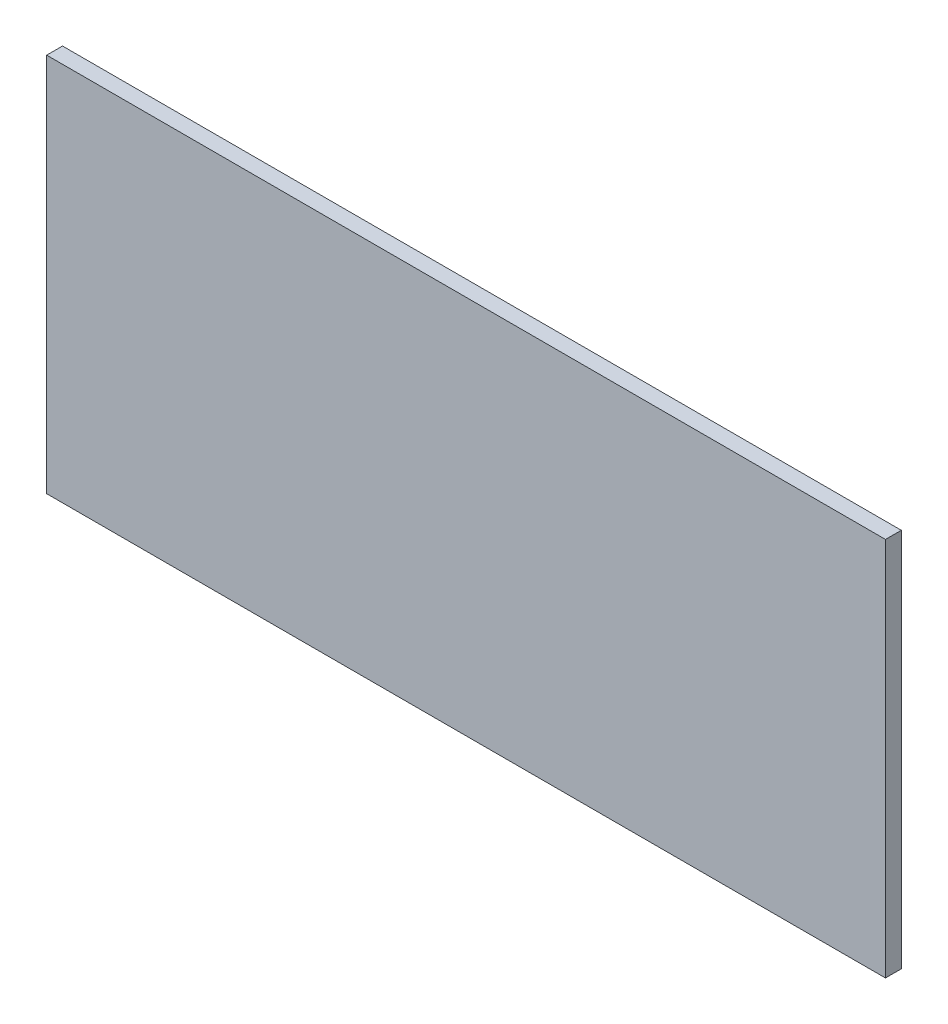
ISO-10303-21;
HEADER;
FILE_DESCRIPTION(('STEP AP214'),'2;1');
FILE_NAME('part.step','',(''),(''),'','','');
FILE_SCHEMA(('AUTOMOTIVE_DESIGN { 1 0 10303 214 1 1 1 1 }'));
ENDSEC;
DATA;
#1=APPLICATION_CONTEXT('core data for automotive mechanical design processes');
#2=APPLICATION_PROTOCOL_DEFINITION('international standard','automotive_design',2000,#1);
#3=PRODUCT_CONTEXT('',#1,'mechanical');
#4=PRODUCT('Part','Part','',(#3));
#5=PRODUCT_RELATED_PRODUCT_CATEGORY('part','',(#4));
#6=PRODUCT_DEFINITION_FORMATION('','',#4);
#7=PRODUCT_DEFINITION_CONTEXT('part definition',#1,'design');
#8=PRODUCT_DEFINITION('design','',#6,#7);
#9=PRODUCT_DEFINITION_SHAPE('','',#8);
#10=(LENGTH_UNIT() NAMED_UNIT(*) SI_UNIT(.MILLI.,.METRE.));
#11=(NAMED_UNIT(*) PLANE_ANGLE_UNIT() SI_UNIT($,.RADIAN.));
#12=(NAMED_UNIT(*) SI_UNIT($,.STERADIAN.) SOLID_ANGLE_UNIT());
#13=UNCERTAINTY_MEASURE_WITH_UNIT(LENGTH_MEASURE(1.E-05),#10,'distance_accuracy_value','');
#14=(GEOMETRIC_REPRESENTATION_CONTEXT(3) GLOBAL_UNCERTAINTY_ASSIGNED_CONTEXT((#13)) GLOBAL_UNIT_ASSIGNED_CONTEXT((#10,
#11,#12)) REPRESENTATION_CONTEXT('',''));
#15=CARTESIAN_POINT('',(0.,0.,0.));
#16=DIRECTION('',(0.,0.,1.));
#17=DIRECTION('',(1.,0.,0.));
#18=AXIS2_PLACEMENT_3D('',#15,#16,#17);
#19=CARTESIAN_POINT('',(-265.,-120.,10.));
#20=DIRECTION('',(0.,1.,0.));
#21=DIRECTION('',(0.,0.,1.));
#22=AXIS2_PLACEMENT_3D('',#19,#20,#21);
#23=PLANE('',#22);
#24=DIRECTION('',(1.,0.,0.));
#25=VECTOR('',#24,1.);
#26=CARTESIAN_POINT('',(-265.,-120.,0.));
#27=LINE('',#26,#25);
#28=CARTESIAN_POINT('',(-265.,-120.,0.));
#29=VERTEX_POINT('',#28);
#30=CARTESIAN_POINT('',(265.,-120.,0.));
#31=VERTEX_POINT('',#30);
#32=EDGE_CURVE('E96',#29,#31,#27,.T.);
#33=ORIENTED_EDGE('',*,*,#32,.T.);
#34=DIRECTION('',(0.,0.,-1.));
#35=VECTOR('',#34,1.);
#36=CARTESIAN_POINT('',(265.,-120.,10.));
#37=LINE('',#36,#35);
#38=CARTESIAN_POINT('',(265.,-120.,10.));
#39=VERTEX_POINT('',#38);
#40=EDGE_CURVE('E11',#39,#31,#37,.T.);
#41=ORIENTED_EDGE('',*,*,#40,.F.);
#42=DIRECTION('',(1.,0.,0.));
#43=VECTOR('',#42,1.);
#44=CARTESIAN_POINT('',(-265.,-120.,10.));
#45=LINE('',#44,#43);
#46=CARTESIAN_POINT('',(-265.,-120.,10.));
#47=VERTEX_POINT('',#46);
#48=EDGE_CURVE('E82',#47,#39,#45,.T.);
#49=ORIENTED_EDGE('',*,*,#48,.F.);
#50=DIRECTION('',(0.,0.,-1.));
#51=VECTOR('',#50,1.);
#52=CARTESIAN_POINT('',(-265.,-120.,10.));
#53=LINE('',#52,#51);
#54=EDGE_CURVE('E49',#47,#29,#53,.T.);
#55=ORIENTED_EDGE('',*,*,#54,.T.);
#56=EDGE_LOOP('',(#33,#41,#49,#55));
#57=FACE_BOUND('',#56,.T.);
#58=ADVANCED_FACE('F33',(#57),#23,.F.);
#59=CARTESIAN_POINT('',(265.,-120.,10.));
#60=DIRECTION('',(-1.,0.,0.));
#61=DIRECTION('',(0.,0.,1.));
#62=AXIS2_PLACEMENT_3D('',#59,#60,#61);
#63=PLANE('',#62);
#64=DIRECTION('',(0.,1.,0.));
#65=VECTOR('',#64,1.);
#66=CARTESIAN_POINT('',(265.,-120.,0.));
#67=LINE('',#66,#65);
#68=CARTESIAN_POINT('',(265.,120.,0.));
#69=VERTEX_POINT('',#68);
#70=EDGE_CURVE('E87',#31,#69,#67,.T.);
#71=ORIENTED_EDGE('',*,*,#70,.T.);
#72=DIRECTION('',(0.,0.,-1.));
#73=VECTOR('',#72,1.);
#74=CARTESIAN_POINT('',(265.,120.,10.));
#75=LINE('',#74,#73);
#76=CARTESIAN_POINT('',(265.,120.,10.));
#77=VERTEX_POINT('',#76);
#78=EDGE_CURVE('E41',#77,#69,#75,.T.);
#79=ORIENTED_EDGE('',*,*,#78,.F.);
#80=DIRECTION('',(0.,1.,0.));
#81=VECTOR('',#80,1.);
#82=CARTESIAN_POINT('',(265.,-120.,10.));
#83=LINE('',#82,#81);
#84=EDGE_CURVE('E74',#39,#77,#83,.T.);
#85=ORIENTED_EDGE('',*,*,#84,.F.);
#86=ORIENTED_EDGE('',*,*,#40,.T.);
#87=EDGE_LOOP('',(#71,#79,#85,#86));
#88=FACE_BOUND('',#87,.T.);
#89=ADVANCED_FACE('F86',(#88),#63,.F.);
#90=CARTESIAN_POINT('',(-265.,120.,10.));
#91=DIRECTION('',(0.,1.,0.));
#92=DIRECTION('',(0.,0.,1.));
#93=AXIS2_PLACEMENT_3D('',#90,#91,#92);
#94=PLANE('',#93);
#95=DIRECTION('',(1.,0.,0.));
#96=VECTOR('',#95,1.);
#97=CARTESIAN_POINT('',(-265.,120.,0.));
#98=LINE('',#97,#96);
#99=CARTESIAN_POINT('',(-265.,120.,0.));
#100=VERTEX_POINT('',#99);
#101=EDGE_CURVE('E99',#100,#69,#98,.T.);
#102=ORIENTED_EDGE('',*,*,#101,.F.);
#103=DIRECTION('',(0.,0.,-1.));
#104=VECTOR('',#103,1.);
#105=CARTESIAN_POINT('',(-265.,120.,10.));
#106=LINE('',#105,#104);
#107=CARTESIAN_POINT('',(-265.,120.,10.));
#108=VERTEX_POINT('',#107);
#109=EDGE_CURVE('E63',#108,#100,#106,.T.);
#110=ORIENTED_EDGE('',*,*,#109,.F.);
#111=DIRECTION('',(1.,0.,0.));
#112=VECTOR('',#111,1.);
#113=CARTESIAN_POINT('',(-265.,120.,10.));
#114=LINE('',#113,#112);
#115=EDGE_CURVE('E81',#108,#77,#114,.T.);
#116=ORIENTED_EDGE('',*,*,#115,.T.);
#117=ORIENTED_EDGE('',*,*,#78,.T.);
#118=EDGE_LOOP('',(#102,#110,#116,#117));
#119=FACE_BOUND('',#118,.T.);
#120=ADVANCED_FACE('F90',(#119),#94,.T.);
#121=CARTESIAN_POINT('',(-265.,-120.,10.));
#122=DIRECTION('',(-1.,0.,0.));
#123=DIRECTION('',(0.,0.,1.));
#124=AXIS2_PLACEMENT_3D('',#121,#122,#123);
#125=PLANE('',#124);
#126=DIRECTION('',(0.,1.,0.));
#127=VECTOR('',#126,1.);
#128=CARTESIAN_POINT('',(-265.,-120.,0.));
#129=LINE('',#128,#127);
#130=EDGE_CURVE('E101',#29,#100,#129,.T.);
#131=ORIENTED_EDGE('',*,*,#130,.F.);
#132=ORIENTED_EDGE('',*,*,#54,.F.);
#133=DIRECTION('',(0.,1.,0.));
#134=VECTOR('',#133,1.);
#135=CARTESIAN_POINT('',(-265.,-120.,10.));
#136=LINE('',#135,#134);
#137=EDGE_CURVE('E91',#47,#108,#136,.T.);
#138=ORIENTED_EDGE('',*,*,#137,.T.);
#139=ORIENTED_EDGE('',*,*,#109,.T.);
#140=EDGE_LOOP('',(#131,#132,#138,#139));
#141=FACE_BOUND('',#140,.T.);
#142=ADVANCED_FACE('F107',(#141),#125,.T.);
#143=CARTESIAN_POINT('',(0.,0.,10.));
#144=DIRECTION('',(0.,0.,1.));
#145=DIRECTION('',(1.,0.,0.));
#146=AXIS2_PLACEMENT_3D('',#143,#144,#145);
#147=PLANE('',#146);
#148=ORIENTED_EDGE('',*,*,#48,.T.);
#149=ORIENTED_EDGE('',*,*,#84,.T.);
#150=ORIENTED_EDGE('',*,*,#115,.F.);
#151=ORIENTED_EDGE('',*,*,#137,.F.);
#152=EDGE_LOOP('',(#148,#149,#150,#151));
#153=FACE_BOUND('',#152,.T.);
#154=ADVANCED_FACE('F78',(#153),#147,.T.);
#155=CARTESIAN_POINT('',(0.,0.,0.));
#156=DIRECTION('',(0.,0.,1.));
#157=DIRECTION('',(1.,0.,0.));
#158=AXIS2_PLACEMENT_3D('',#155,#156,#157);
#159=PLANE('',#158);
#160=ORIENTED_EDGE('',*,*,#32,.F.);
#161=ORIENTED_EDGE('',*,*,#130,.T.);
#162=ORIENTED_EDGE('',*,*,#101,.T.);
#163=ORIENTED_EDGE('',*,*,#70,.F.);
#164=EDGE_LOOP('',(#160,#161,#162,#163));
#165=FACE_BOUND('',#164,.T.);
#166=ADVANCED_FACE('F106',(#165),#159,.F.);
#167=CLOSED_SHELL('',(#58,#89,#120,#142,#154,#166));
#168=MANIFOLD_SOLID_BREP('B2',#167);
#169=ADVANCED_BREP_SHAPE_REPRESENTATION('',(#18,#168),#14);
#170=SHAPE_DEFINITION_REPRESENTATION(#9,#169);
ENDSEC;
END-ISO-10303-21;
